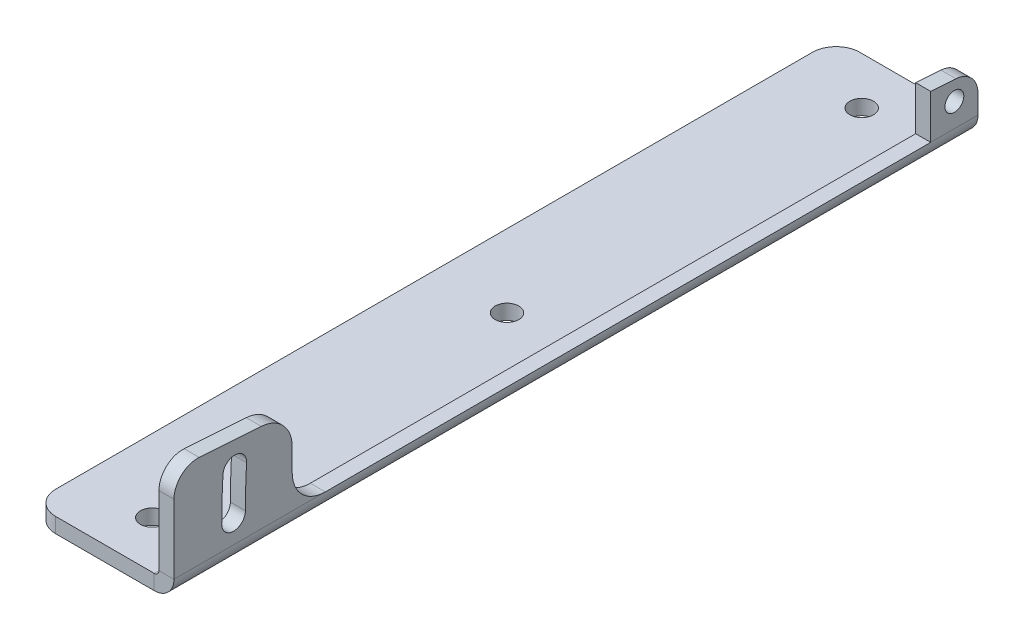
ISO-10303-21;
HEADER;
FILE_DESCRIPTION(('STEP AP214'),'2;1');
FILE_NAME('part.step','',(''),(''),'','','');
FILE_SCHEMA(('AUTOMOTIVE_DESIGN { 1 0 10303 214 1 1 1 1 }'));
ENDSEC;
DATA;
#1=APPLICATION_CONTEXT('core data for automotive mechanical design processes');
#2=APPLICATION_PROTOCOL_DEFINITION('international standard','automotive_design',2000,#1);
#3=PRODUCT_CONTEXT('',#1,'mechanical');
#4=PRODUCT('Part','Part','',(#3));
#5=PRODUCT_RELATED_PRODUCT_CATEGORY('part','',(#4));
#6=PRODUCT_DEFINITION_FORMATION('','',#4);
#7=PRODUCT_DEFINITION_CONTEXT('part definition',#1,'design');
#8=PRODUCT_DEFINITION('design','',#6,#7);
#9=PRODUCT_DEFINITION_SHAPE('','',#8);
#10=(LENGTH_UNIT() NAMED_UNIT(*) SI_UNIT(.MILLI.,.METRE.));
#11=(NAMED_UNIT(*) PLANE_ANGLE_UNIT() SI_UNIT($,.RADIAN.));
#12=(NAMED_UNIT(*) SI_UNIT($,.STERADIAN.) SOLID_ANGLE_UNIT());
#13=UNCERTAINTY_MEASURE_WITH_UNIT(LENGTH_MEASURE(1.E-05),#10,'distance_accuracy_value','');
#14=(GEOMETRIC_REPRESENTATION_CONTEXT(3) GLOBAL_UNCERTAINTY_ASSIGNED_CONTEXT((#13)) GLOBAL_UNIT_ASSIGNED_CONTEXT((#10,
#11,#12)) REPRESENTATION_CONTEXT('',''));
#15=CARTESIAN_POINT('',(0.,0.,0.));
#16=DIRECTION('',(0.,0.,1.));
#17=DIRECTION('',(1.,0.,0.));
#18=AXIS2_PLACEMENT_3D('',#15,#16,#17);
#19=CARTESIAN_POINT('',(0.,0.,170.));
#20=DIRECTION('',(1.,0.,0.));
#21=DIRECTION('',(0.,0.,-1.));
#22=AXIS2_PLACEMENT_3D('',#19,#20,#21);
#23=PLANE('',#22);
#24=CARTESIAN_POINT('',(0.,9.175,5.));
#25=DIRECTION('',(1.,0.,0.));
#26=DIRECTION('',(0.,0.,-1.));
#27=AXIS2_PLACEMENT_3D('',#24,#25,#26);
#28=CIRCLE('',#27,154.9);
#29=CARTESIAN_POINT('',(0.,9.175,159.9));
#30=VERTEX_POINT('',#29);
#31=CARTESIAN_POINT('',(0.,18.1447670603674,159.640076561294));
#32=VERTEX_POINT('',#31);
#33=EDGE_CURVE('E163',#30,#32,#28,.F.);
#34=ORIENTED_EDGE('',*,*,#33,.T.);
#35=CARTESIAN_POINT('',(0.,18.,157.144271581286));
#36=DIRECTION('',(1.,0.,0.));
#37=DIRECTION('',(0.,0.,-1.));
#38=AXIS2_PLACEMENT_3D('',#35,#36,#37);
#39=CIRCLE('',#38,2.49999999999999);
#40=CARTESIAN_POINT('',(0.,17.8552329396325,154.648466601278));
#41=VERTEX_POINT('',#40);
#42=EDGE_CURVE('E160',#32,#41,#39,.F.);
#43=ORIENTED_EDGE('',*,*,#42,.T.);
#44=CARTESIAN_POINT('',(0.,9.175,5.));
#45=DIRECTION('',(1.,0.,0.));
#46=DIRECTION('',(0.,0.,-1.));
#47=AXIS2_PLACEMENT_3D('',#44,#45,#46);
#48=CIRCLE('',#47,149.9);
#49=CARTESIAN_POINT('',(0.,9.175,154.9));
#50=VERTEX_POINT('',#49);
#51=EDGE_CURVE('E169',#50,#41,#48,.F.);
#52=ORIENTED_EDGE('',*,*,#51,.F.);
#53=CARTESIAN_POINT('',(0.,9.175,157.4));
#54=DIRECTION('',(1.,0.,0.));
#55=DIRECTION('',(0.,0.,-1.));
#56=AXIS2_PLACEMENT_3D('',#53,#54,#55);
#57=CIRCLE('',#56,2.5);
#58=EDGE_CURVE('E166',#50,#30,#57,.F.);
#59=ORIENTED_EDGE('',*,*,#58,.T.);
#60=EDGE_LOOP('',(#34,#43,#52,#59));
#61=FACE_BOUND('',#60,.T.);
#62=DIRECTION('',(0.,1.,0.));
#63=VECTOR('',#62,1.);
#64=CARTESIAN_POINT('',(0.,0.,145.));
#65=LINE('',#64,#63);
#66=CARTESIAN_POINT('',(0.,11.175,145.));
#67=VERTEX_POINT('',#66);
#68=CARTESIAN_POINT('',(0.,15.9604537596054,145.));
#69=VERTEX_POINT('',#68);
#70=EDGE_CURVE('E111',#67,#69,#65,.T.);
#71=ORIENTED_EDGE('',*,*,#70,.T.);
#72=CARTESIAN_POINT('',(0.,15.9604537596054,152.));
#73=DIRECTION('',(1.,0.,0.));
#74=DIRECTION('',(0.,0.,-1.));
#75=AXIS2_PLACEMENT_3D('',#72,#73,#74);
#76=CIRCLE('',#75,7.);
#77=CARTESIAN_POINT('',(0.,22.9449747604819,151.534740515072));
#78=VERTEX_POINT('',#77);
#79=EDGE_CURVE('E99',#69,#78,#76,.T.);
#80=ORIENTED_EDGE('',*,*,#79,.T.);
#81=DIRECTION('',(0.,0.0664656407040233,0.997788714410924));
#82=VECTOR('',#81,1.);
#83=CARTESIAN_POINT('',(0.,12.850800040137,0.));
#84=LINE('',#83,#82);
#85=CARTESIAN_POINT('',(0.,23.8197979363042,164.66767179648));
#86=VERTEX_POINT('',#85);
#87=EDGE_CURVE('E138',#78,#86,#84,.T.);
#88=ORIENTED_EDGE('',*,*,#87,.T.);
#89=CARTESIAN_POINT('',(0.,18.8308543642496,165.));
#90=DIRECTION('',(1.,0.,0.));
#91=DIRECTION('',(0.,0.,-1.));
#92=AXIS2_PLACEMENT_3D('',#89,#90,#91);
#93=CIRCLE('',#92,5.);
#94=CARTESIAN_POINT('',(0.,18.8308543642496,170.));
#95=VERTEX_POINT('',#94);
#96=EDGE_CURVE('E303',#86,#95,#93,.T.);
#97=ORIENTED_EDGE('',*,*,#96,.T.);
#98=DIRECTION('',(0.,-1.,0.));
#99=VECTOR('',#98,1.);
#100=CARTESIAN_POINT('',(0.,0.,170.));
#101=LINE('',#100,#99);
#102=CARTESIAN_POINT('',(0.,4.175,170.));
#103=VERTEX_POINT('',#102);
#104=EDGE_CURVE('E197',#95,#103,#101,.T.);
#105=ORIENTED_EDGE('',*,*,#104,.T.);
#106=DIRECTION('',(0.,0.,-1.));
#107=VECTOR('',#106,1.);
#108=CARTESIAN_POINT('',(0.,4.175,170.));
#109=LINE('',#108,#107);
#110=CARTESIAN_POINT('',(0.,4.175,138.));
#111=VERTEX_POINT('',#110);
#112=EDGE_CURVE('E74',#103,#111,#109,.T.);
#113=ORIENTED_EDGE('',*,*,#112,.T.);
#114=CARTESIAN_POINT('',(0.,11.175,138.));
#115=DIRECTION('',(1.,0.,0.));
#116=DIRECTION('',(0.,0.,-1.));
#117=AXIS2_PLACEMENT_3D('',#114,#115,#116);
#118=CIRCLE('',#117,7.);
#119=EDGE_CURVE('E44',#111,#67,#118,.F.);
#120=ORIENTED_EDGE('',*,*,#119,.T.);
#121=EDGE_LOOP('',(#71,#80,#88,#97,#105,#113,#120));
#122=FACE_BOUND('',#121,.T.);
#123=ADVANCED_FACE('F36',(#61,#122),#23,.T.);
#124=CARTESIAN_POINT('',(0.,9.175,5.));
#125=DIRECTION('',(1.,0.,0.));
#126=DIRECTION('',(0.,0.,-1.));
#127=AXIS2_PLACEMENT_3D('',#124,#125,#126);
#128=CIRCLE('',#127,2.);
#129=CARTESIAN_POINT('',(0.,9.175,3.));
#130=VERTEX_POINT('',#129);
#131=EDGE_CURVE('E159',#130,#130,#128,.F.);
#132=ORIENTED_EDGE('',*,*,#131,.T.);
#133=EDGE_LOOP('',(#132));
#134=FACE_BOUND('',#133,.T.);
#135=CARTESIAN_POINT('',(0.,13.1617273858449,4.66767179647988));
#136=VERTEX_POINT('',#135);
#137=CARTESIAN_POINT('',(0.,13.5169294495407,10.));
#138=VERTEX_POINT('',#137);
#139=EDGE_CURVE('E134',#136,#138,#84,.T.);
#140=ORIENTED_EDGE('',*,*,#139,.T.);
#141=DIRECTION('',(0.,-1.,0.));
#142=VECTOR('',#141,1.);
#143=CARTESIAN_POINT('',(0.,0.,10.));
#144=LINE('',#143,#142);
#145=CARTESIAN_POINT('',(0.,4.175,10.));
#146=VERTEX_POINT('',#145);
#147=EDGE_CURVE('E86',#138,#146,#144,.T.);
#148=ORIENTED_EDGE('',*,*,#147,.T.);
#149=CARTESIAN_POINT('',(0.,4.175,0.));
#150=VERTEX_POINT('',#149);
#151=EDGE_CURVE('E227',#146,#150,#109,.T.);
#152=ORIENTED_EDGE('',*,*,#151,.T.);
#153=DIRECTION('',(0.,-1.,0.));
#154=VECTOR('',#153,1.);
#155=CARTESIAN_POINT('',(0.,0.,0.));
#156=LINE('',#155,#154);
#157=CARTESIAN_POINT('',(0.,8.1727838137903,0.));
#158=VERTEX_POINT('',#157);
#159=EDGE_CURVE('E215',#158,#150,#156,.T.);
#160=ORIENTED_EDGE('',*,*,#159,.F.);
#161=CARTESIAN_POINT('',(0.,8.1727838137903,5.));
#162=DIRECTION('',(1.,0.,0.));
#163=DIRECTION('',(0.,0.,-1.));
#164=AXIS2_PLACEMENT_3D('',#161,#162,#163);
#165=CIRCLE('',#164,5.);
#166=EDGE_CURVE('E305',#158,#136,#165,.T.);
#167=ORIENTED_EDGE('',*,*,#166,.T.);
#168=EDGE_LOOP('',(#140,#148,#152,#160,#167));
#169=FACE_BOUND('',#168,.T.);
#170=ADVANCED_FACE('F350',(#134,#169),#23,.T.);
#171=CARTESIAN_POINT('',(-3.175,0.,170.));
#172=DIRECTION('',(1.,0.,0.));
#173=DIRECTION('',(0.,0.,-1.));
#174=AXIS2_PLACEMENT_3D('',#171,#172,#173);
#175=PLANE('',#174);
#176=CARTESIAN_POINT('',(-3.175,18.,157.144271581286));
#177=DIRECTION('',(1.,0.,0.));
#178=DIRECTION('',(0.,0.,-1.));
#179=AXIS2_PLACEMENT_3D('',#176,#177,#178);
#180=CIRCLE('',#179,2.49999999999999);
#181=CARTESIAN_POINT('',(-3.175,18.1447670603674,159.640076561294));
#182=VERTEX_POINT('',#181);
#183=CARTESIAN_POINT('',(-3.175,17.8552329396325,154.648466601278));
#184=VERTEX_POINT('',#183);
#185=EDGE_CURVE('E285',#182,#184,#180,.F.);
#186=ORIENTED_EDGE('',*,*,#185,.F.);
#187=CARTESIAN_POINT('',(-3.175,9.175,5.));
#188=DIRECTION('',(1.,0.,0.));
#189=DIRECTION('',(0.,0.,-1.));
#190=AXIS2_PLACEMENT_3D('',#187,#188,#189);
#191=CIRCLE('',#190,154.9);
#192=CARTESIAN_POINT('',(-3.175,9.175,159.9));
#193=VERTEX_POINT('',#192);
#194=EDGE_CURVE('E274',#193,#182,#191,.F.);
#195=ORIENTED_EDGE('',*,*,#194,.F.);
#196=CARTESIAN_POINT('',(-3.175,9.175,157.4));
#197=DIRECTION('',(1.,0.,0.));
#198=DIRECTION('',(0.,0.,-1.));
#199=AXIS2_PLACEMENT_3D('',#196,#197,#198);
#200=CIRCLE('',#199,2.5);
#201=CARTESIAN_POINT('',(-3.175,9.175,154.9));
#202=VERTEX_POINT('',#201);
#203=EDGE_CURVE('E279',#202,#193,#200,.F.);
#204=ORIENTED_EDGE('',*,*,#203,.F.);
#205=CARTESIAN_POINT('',(-3.175,9.175,5.));
#206=DIRECTION('',(1.,0.,0.));
#207=DIRECTION('',(0.,0.,-1.));
#208=AXIS2_PLACEMENT_3D('',#205,#206,#207);
#209=CIRCLE('',#208,149.9);
#210=EDGE_CURVE('E282',#202,#184,#209,.F.);
#211=ORIENTED_EDGE('',*,*,#210,.T.);
#212=EDGE_LOOP('',(#186,#195,#204,#211));
#213=FACE_BOUND('',#212,.T.);
#214=DIRECTION('',(0.,0.0664656407040233,0.997788714410924));
#215=VECTOR('',#214,1.);
#216=CARTESIAN_POINT('',(-3.175,12.850800040137,0.));
#217=LINE('',#216,#215);
#218=CARTESIAN_POINT('',(-3.175,22.9449747604819,151.534740515072));
#219=VERTEX_POINT('',#218);
#220=CARTESIAN_POINT('',(-3.175,23.8197979363042,164.66767179648));
#221=VERTEX_POINT('',#220);
#222=EDGE_CURVE('E132',#219,#221,#217,.T.);
#223=ORIENTED_EDGE('',*,*,#222,.F.);
#224=CARTESIAN_POINT('',(-3.175,15.9604537596054,152.));
#225=DIRECTION('',(1.,0.,0.));
#226=DIRECTION('',(0.,0.,-1.));
#227=AXIS2_PLACEMENT_3D('',#224,#225,#226);
#228=CIRCLE('',#227,7.);
#229=CARTESIAN_POINT('',(-3.175,15.9604537596054,145.));
#230=VERTEX_POINT('',#229);
#231=EDGE_CURVE('E315',#219,#230,#228,.F.);
#232=ORIENTED_EDGE('',*,*,#231,.T.);
#233=DIRECTION('',(0.,1.,0.));
#234=VECTOR('',#233,1.);
#235=CARTESIAN_POINT('',(-3.175,13.3423382382454,145.));
#236=LINE('',#235,#234);
#237=CARTESIAN_POINT('',(-3.175,11.175,145.));
#238=VERTEX_POINT('',#237);
#239=EDGE_CURVE('E114',#238,#230,#236,.T.);
#240=ORIENTED_EDGE('',*,*,#239,.F.);
#241=CARTESIAN_POINT('',(-3.175,11.175,138.));
#242=DIRECTION('',(1.,0.,0.));
#243=DIRECTION('',(0.,0.,-1.));
#244=AXIS2_PLACEMENT_3D('',#241,#242,#243);
#245=CIRCLE('',#244,7.);
#246=CARTESIAN_POINT('',(-3.175,4.175,138.));
#247=VERTEX_POINT('',#246);
#248=EDGE_CURVE('E11',#238,#247,#245,.T.);
#249=ORIENTED_EDGE('',*,*,#248,.T.);
#250=DIRECTION('',(0.,0.,-1.));
#251=VECTOR('',#250,1.);
#252=CARTESIAN_POINT('',(-3.175,4.175,170.));
#253=LINE('',#252,#251);
#254=CARTESIAN_POINT('',(-3.175,4.175,170.));
#255=VERTEX_POINT('',#254);
#256=EDGE_CURVE('E51',#255,#247,#253,.T.);
#257=ORIENTED_EDGE('',*,*,#256,.F.);
#258=DIRECTION('',(0.,1.,0.));
#259=VECTOR('',#258,1.);
#260=CARTESIAN_POINT('',(-3.175,0.,170.));
#261=LINE('',#260,#259);
#262=CARTESIAN_POINT('',(-3.175,18.8308543642496,170.));
#263=VERTEX_POINT('',#262);
#264=EDGE_CURVE('E199',#263,#255,#261,.F.);
#265=ORIENTED_EDGE('',*,*,#264,.F.);
#266=CARTESIAN_POINT('',(-3.175,18.8308543642496,165.));
#267=DIRECTION('',(1.,0.,0.));
#268=DIRECTION('',(0.,0.,-1.));
#269=AXIS2_PLACEMENT_3D('',#266,#267,#268);
#270=CIRCLE('',#269,5.);
#271=EDGE_CURVE('E294',#263,#221,#270,.F.);
#272=ORIENTED_EDGE('',*,*,#271,.T.);
#273=EDGE_LOOP('',(#223,#232,#240,#249,#257,#265,#272));
#274=FACE_BOUND('',#273,.T.);
#275=ADVANCED_FACE('F317',(#213,#274),#175,.F.);
#276=CARTESIAN_POINT('',(-3.175,9.175,5.));
#277=DIRECTION('',(1.,0.,0.));
#278=DIRECTION('',(0.,0.,-1.));
#279=AXIS2_PLACEMENT_3D('',#276,#277,#278);
#280=CIRCLE('',#279,2.);
#281=CARTESIAN_POINT('',(-3.175,9.175,3.));
#282=VERTEX_POINT('',#281);
#283=EDGE_CURVE('E176',#282,#282,#280,.F.);
#284=ORIENTED_EDGE('',*,*,#283,.F.);
#285=EDGE_LOOP('',(#284));
#286=FACE_BOUND('',#285,.T.);
#287=DIRECTION('',(0.,1.,0.));
#288=VECTOR('',#287,1.);
#289=CARTESIAN_POINT('',(-3.175,13.3423382382454,10.));
#290=LINE('',#289,#288);
#291=CARTESIAN_POINT('',(-3.175,13.5169294495407,10.));
#292=VERTEX_POINT('',#291);
#293=CARTESIAN_POINT('',(-3.175,4.175,10.));
#294=VERTEX_POINT('',#293);
#295=EDGE_CURVE('E129',#292,#294,#290,.F.);
#296=ORIENTED_EDGE('',*,*,#295,.F.);
#297=CARTESIAN_POINT('',(-3.175,13.1617273858449,4.66767179647988));
#298=VERTEX_POINT('',#297);
#299=EDGE_CURVE('E139',#298,#292,#217,.T.);
#300=ORIENTED_EDGE('',*,*,#299,.F.);
#301=CARTESIAN_POINT('',(-3.175,8.1727838137903,5.));
#302=DIRECTION('',(1.,0.,0.));
#303=DIRECTION('',(0.,0.,-1.));
#304=AXIS2_PLACEMENT_3D('',#301,#302,#303);
#305=CIRCLE('',#304,5.);
#306=CARTESIAN_POINT('',(-3.175,8.1727838137903,0.));
#307=VERTEX_POINT('',#306);
#308=EDGE_CURVE('E297',#298,#307,#305,.F.);
#309=ORIENTED_EDGE('',*,*,#308,.T.);
#310=DIRECTION('',(0.,1.,0.));
#311=VECTOR('',#310,1.);
#312=CARTESIAN_POINT('',(-3.175,0.,0.));
#313=LINE('',#312,#311);
#314=CARTESIAN_POINT('',(-3.175,4.175,0.));
#315=VERTEX_POINT('',#314);
#316=EDGE_CURVE('E218',#307,#315,#313,.F.);
#317=ORIENTED_EDGE('',*,*,#316,.T.);
#318=EDGE_CURVE('E225',#294,#315,#253,.T.);
#319=ORIENTED_EDGE('',*,*,#318,.F.);
#320=EDGE_LOOP('',(#296,#300,#309,#317,#319));
#321=FACE_BOUND('',#320,.T.);
#322=ADVANCED_FACE('F361',(#286,#321),#175,.F.);
#323=CARTESIAN_POINT('',(0.,12.850800040137,0.));
#324=DIRECTION('',(0.,-0.997788714410924,0.0664656407040234));
#325=DIRECTION('',(0.,-0.0664656407040234,-0.997788714410924));
#326=AXIS2_PLACEMENT_3D('',#323,#324,#325);
#327=PLANE('',#326);
#328=ORIENTED_EDGE('',*,*,#87,.F.);
#329=DIRECTION('',(-1.,0.,0.));
#330=VECTOR('',#329,1.);
#331=CARTESIAN_POINT('',(-3.175,22.9449747604819,151.534740515072));
#332=LINE('',#331,#330);
#333=EDGE_CURVE('E60',#78,#219,#332,.T.);
#334=ORIENTED_EDGE('',*,*,#333,.T.);
#335=ORIENTED_EDGE('',*,*,#222,.T.);
#336=DIRECTION('',(-1.,0.,0.));
#337=VECTOR('',#336,1.);
#338=CARTESIAN_POINT('',(0.,23.8197979363042,164.66767179648));
#339=LINE('',#338,#337);
#340=EDGE_CURVE('E288',#221,#86,#339,.F.);
#341=ORIENTED_EDGE('',*,*,#340,.T.);
#342=EDGE_LOOP('',(#328,#334,#335,#341));
#343=FACE_BOUND('',#342,.T.);
#344=ADVANCED_FACE('F323',(#343),#327,.F.);
#345=DIRECTION('',(-1.,0.,0.));
#346=VECTOR('',#345,1.);
#347=CARTESIAN_POINT('',(0.,13.5169294495407,10.));
#348=LINE('',#347,#346);
#349=EDGE_CURVE('E117',#292,#138,#348,.F.);
#350=ORIENTED_EDGE('',*,*,#349,.T.);
#351=ORIENTED_EDGE('',*,*,#139,.F.);
#352=DIRECTION('',(-1.,0.,0.));
#353=VECTOR('',#352,1.);
#354=CARTESIAN_POINT('',(-3.175,13.1617273858449,4.66767179647988));
#355=LINE('',#354,#353);
#356=EDGE_CURVE('E291',#136,#298,#355,.T.);
#357=ORIENTED_EDGE('',*,*,#356,.T.);
#358=ORIENTED_EDGE('',*,*,#299,.T.);
#359=EDGE_LOOP('',(#350,#351,#357,#358));
#360=FACE_BOUND('',#359,.T.);
#361=ADVANCED_FACE('F357',(#360),#327,.F.);
#362=CARTESIAN_POINT('',(-4.175,0.,170.));
#363=DIRECTION('',(0.,0.,1.));
#364=DIRECTION('',(1.,0.,0.));
#365=AXIS2_PLACEMENT_3D('',#362,#363,#364);
#366=PLANE('',#365);
#367=DIRECTION('',(0.,1.,0.));
#368=VECTOR('',#367,1.);
#369=CARTESIAN_POINT('',(-4.175,0.,170.));
#370=LINE('',#369,#368);
#371=CARTESIAN_POINT('',(-4.175,0.,170.));
#372=VERTEX_POINT('',#371);
#373=CARTESIAN_POINT('',(-4.175,3.175,170.));
#374=VERTEX_POINT('',#373);
#375=EDGE_CURVE('E247',#372,#374,#370,.T.);
#376=ORIENTED_EDGE('',*,*,#375,.F.);
#377=CARTESIAN_POINT('',(-4.175,4.175,170.));
#378=DIRECTION('',(0.,0.,-1.));
#379=DIRECTION('',(-1.,0.,0.));
#380=AXIS2_PLACEMENT_3D('',#377,#378,#379);
#381=CIRCLE('',#380,4.175);
#382=EDGE_CURVE('E194',#103,#372,#381,.T.);
#383=ORIENTED_EDGE('',*,*,#382,.F.);
#384=DIRECTION('',(1.,0.,0.));
#385=VECTOR('',#384,1.);
#386=CARTESIAN_POINT('',(-3.175,4.175,170.));
#387=LINE('',#386,#385);
#388=EDGE_CURVE('E244',#255,#103,#387,.T.);
#389=ORIENTED_EDGE('',*,*,#388,.F.);
#390=CARTESIAN_POINT('',(-4.175,4.175,170.));
#391=DIRECTION('',(0.,0.,1.));
#392=DIRECTION('',(1.,0.,0.));
#393=AXIS2_PLACEMENT_3D('',#390,#391,#392);
#394=CIRCLE('',#393,1.);
#395=EDGE_CURVE('E202',#255,#374,#394,.F.);
#396=ORIENTED_EDGE('',*,*,#395,.T.);
#397=EDGE_LOOP('',(#376,#383,#389,#396));
#398=FACE_BOUND('',#397,.T.);
#399=ADVANCED_FACE('F464',(#398),#366,.T.);
#400=CARTESIAN_POINT('',(-3.175,4.175,170.));
#401=DIRECTION('',(0.,0.,1.));
#402=DIRECTION('',(1.,0.,0.));
#403=AXIS2_PLACEMENT_3D('',#400,#401,#402);
#404=PLANE('',#403);
#405=DIRECTION('',(1.,0.,0.));
#406=VECTOR('',#405,1.);
#407=CARTESIAN_POINT('',(0.,3.175,170.));
#408=LINE('',#407,#406);
#409=CARTESIAN_POINT('',(-25.,3.175,170.));
#410=VERTEX_POINT('',#409);
#411=EDGE_CURVE('E187',#374,#410,#408,.F.);
#412=ORIENTED_EDGE('',*,*,#411,.T.);
#413=DIRECTION('',(0.,1.,0.));
#414=VECTOR('',#413,1.);
#415=CARTESIAN_POINT('',(-25.,4.175,170.));
#416=LINE('',#415,#414);
#417=CARTESIAN_POINT('',(-25.,0.,170.));
#418=VERTEX_POINT('',#417);
#419=EDGE_CURVE('E271',#410,#418,#416,.F.);
#420=ORIENTED_EDGE('',*,*,#419,.T.);
#421=DIRECTION('',(-1.,0.,0.));
#422=VECTOR('',#421,1.);
#423=CARTESIAN_POINT('',(0.,0.,170.));
#424=LINE('',#423,#422);
#425=EDGE_CURVE('E190',#372,#418,#424,.T.);
#426=ORIENTED_EDGE('',*,*,#425,.F.);
#427=ORIENTED_EDGE('',*,*,#375,.T.);
#428=EDGE_LOOP('',(#412,#420,#426,#427));
#429=FACE_BOUND('',#428,.T.);
#430=ADVANCED_FACE('F459',(#429),#404,.T.);
#431=CARTESIAN_POINT('',(0.,4.175,0.));
#432=DIRECTION('',(0.,0.,-1.));
#433=DIRECTION('',(-1.,0.,0.));
#434=AXIS2_PLACEMENT_3D('',#431,#432,#433);
#435=PLANE('',#434);
#436=DIRECTION('',(-1.,0.,0.));
#437=VECTOR('',#436,1.);
#438=CARTESIAN_POINT('',(0.,4.175,0.));
#439=LINE('',#438,#437);
#440=EDGE_CURVE('E241',#150,#315,#439,.T.);
#441=ORIENTED_EDGE('',*,*,#440,.F.);
#442=CARTESIAN_POINT('',(-4.175,4.175,0.));
#443=DIRECTION('',(0.,0.,-1.));
#444=DIRECTION('',(-1.,0.,0.));
#445=AXIS2_PLACEMENT_3D('',#442,#443,#444);
#446=CIRCLE('',#445,4.175);
#447=CARTESIAN_POINT('',(-4.175,0.,0.));
#448=VERTEX_POINT('',#447);
#449=EDGE_CURVE('E212',#150,#448,#446,.T.);
#450=ORIENTED_EDGE('',*,*,#449,.T.);
#451=DIRECTION('',(0.,-1.,0.));
#452=VECTOR('',#451,1.);
#453=CARTESIAN_POINT('',(-4.175,3.175,0.));
#454=LINE('',#453,#452);
#455=CARTESIAN_POINT('',(-4.175,3.175,0.));
#456=VERTEX_POINT('',#455);
#457=EDGE_CURVE('E238',#456,#448,#454,.T.);
#458=ORIENTED_EDGE('',*,*,#457,.F.);
#459=CARTESIAN_POINT('',(-4.175,4.175,0.));
#460=DIRECTION('',(0.,0.,1.));
#461=DIRECTION('',(1.,0.,0.));
#462=AXIS2_PLACEMENT_3D('',#459,#460,#461);
#463=CIRCLE('',#462,1.);
#464=EDGE_CURVE('E191',#315,#456,#463,.F.);
#465=ORIENTED_EDGE('',*,*,#464,.F.);
#466=EDGE_LOOP('',(#441,#450,#458,#465));
#467=FACE_BOUND('',#466,.T.);
#468=ADVANCED_FACE('F388',(#467),#435,.T.);
#469=CARTESIAN_POINT('',(-4.175,3.175,0.));
#470=DIRECTION('',(0.,0.,-1.));
#471=DIRECTION('',(-1.,0.,0.));
#472=AXIS2_PLACEMENT_3D('',#469,#470,#471);
#473=PLANE('',#472);
#474=ORIENTED_EDGE('',*,*,#316,.F.);
#475=DIRECTION('',(-1.,0.,0.));
#476=VECTOR('',#475,1.);
#477=CARTESIAN_POINT('',(0.,8.1727838137903,0.));
#478=LINE('',#477,#476);
#479=EDGE_CURVE('E300',#307,#158,#478,.F.);
#480=ORIENTED_EDGE('',*,*,#479,.T.);
#481=ORIENTED_EDGE('',*,*,#159,.T.);
#482=ORIENTED_EDGE('',*,*,#440,.T.);
#483=EDGE_LOOP('',(#474,#480,#481,#482));
#484=FACE_BOUND('',#483,.T.);
#485=ADVANCED_FACE('F343',(#484),#473,.T.);
#486=CARTESIAN_POINT('',(0.,3.175,170.));
#487=DIRECTION('',(0.,-1.,0.));
#488=DIRECTION('',(0.,0.,-1.));
#489=AXIS2_PLACEMENT_3D('',#486,#487,#488);
#490=PLANE('',#489);
#491=CARTESIAN_POINT('',(-14.5875,3.175,160.));
#492=DIRECTION('',(0.,-1.,0.));
#493=DIRECTION('',(0.,0.,-1.));
#494=AXIS2_PLACEMENT_3D('',#491,#492,#493);
#495=CIRCLE('',#494,2.5);
#496=CARTESIAN_POINT('',(-14.5875,3.175,157.5));
#497=VERTEX_POINT('',#496);
#498=EDGE_CURVE('E156',#497,#497,#495,.T.);
#499=ORIENTED_EDGE('',*,*,#498,.T.);
#500=EDGE_LOOP('',(#499));
#501=FACE_BOUND('',#500,.T.);
#502=CARTESIAN_POINT('',(-14.5875,3.175,85.));
#503=DIRECTION('',(0.,-1.,0.));
#504=DIRECTION('',(0.,0.,-1.));
#505=AXIS2_PLACEMENT_3D('',#502,#503,#504);
#506=CIRCLE('',#505,2.5);
#507=CARTESIAN_POINT('',(-14.5875,3.175,82.5));
#508=VERTEX_POINT('',#507);
#509=EDGE_CURVE('E153',#508,#508,#506,.T.);
#510=ORIENTED_EDGE('',*,*,#509,.T.);
#511=EDGE_LOOP('',(#510));
#512=FACE_BOUND('',#511,.T.);
#513=CARTESIAN_POINT('',(-14.5875,3.175,10.));
#514=DIRECTION('',(0.,-1.,0.));
#515=DIRECTION('',(0.,0.,-1.));
#516=AXIS2_PLACEMENT_3D('',#513,#514,#515);
#517=CIRCLE('',#516,2.5);
#518=CARTESIAN_POINT('',(-14.5875,3.175,7.5));
#519=VERTEX_POINT('',#518);
#520=EDGE_CURVE('E145',#519,#519,#517,.T.);
#521=ORIENTED_EDGE('',*,*,#520,.T.);
#522=EDGE_LOOP('',(#521));
#523=FACE_BOUND('',#522,.T.);
#524=DIRECTION('',(1.,0.,0.));
#525=VECTOR('',#524,1.);
#526=CARTESIAN_POINT('',(0.,3.175,0.));
#527=LINE('',#526,#525);
#528=CARTESIAN_POINT('',(-25.,3.175,0.));
#529=VERTEX_POINT('',#528);
#530=EDGE_CURVE('E206',#456,#529,#527,.F.);
#531=ORIENTED_EDGE('',*,*,#530,.T.);
#532=CARTESIAN_POINT('',(-25.,3.175,5.));
#533=DIRECTION('',(0.,-1.,0.));
#534=DIRECTION('',(0.,0.,-1.));
#535=AXIS2_PLACEMENT_3D('',#532,#533,#534);
#536=CIRCLE('',#535,5.);
#537=CARTESIAN_POINT('',(-30.,3.175,5.));
#538=VERTEX_POINT('',#537);
#539=EDGE_CURVE('E256',#529,#538,#536,.F.);
#540=ORIENTED_EDGE('',*,*,#539,.T.);
#541=DIRECTION('',(0.,0.,-1.));
#542=VECTOR('',#541,1.);
#543=CARTESIAN_POINT('',(-30.,3.175,170.));
#544=LINE('',#543,#542);
#545=CARTESIAN_POINT('',(-30.,3.175,165.));
#546=VERTEX_POINT('',#545);
#547=EDGE_CURVE('E235',#546,#538,#544,.T.);
#548=ORIENTED_EDGE('',*,*,#547,.F.);
#549=CARTESIAN_POINT('',(-25.,3.175,165.));
#550=DIRECTION('',(0.,-1.,0.));
#551=DIRECTION('',(0.,0.,-1.));
#552=AXIS2_PLACEMENT_3D('',#549,#550,#551);
#553=CIRCLE('',#552,5.);
#554=EDGE_CURVE('E253',#546,#410,#553,.F.);
#555=ORIENTED_EDGE('',*,*,#554,.T.);
#556=ORIENTED_EDGE('',*,*,#411,.F.);
#557=DIRECTION('',(0.,0.,-1.));
#558=VECTOR('',#557,1.);
#559=CARTESIAN_POINT('',(-4.175,3.175,170.));
#560=LINE('',#559,#558);
#561=EDGE_CURVE('E205',#374,#456,#560,.T.);
#562=ORIENTED_EDGE('',*,*,#561,.T.);
#563=EDGE_LOOP('',(#531,#540,#548,#555,#556,#562));
#564=FACE_BOUND('',#563,.T.);
#565=ADVANCED_FACE('F467',(#501,#512,#523,#564),#490,.F.);
#566=CARTESIAN_POINT('',(-30.,0.,170.));
#567=DIRECTION('',(-1.,0.,0.));
#568=DIRECTION('',(0.,0.,1.));
#569=AXIS2_PLACEMENT_3D('',#566,#567,#568);
#570=PLANE('',#569);
#571=ORIENTED_EDGE('',*,*,#547,.T.);
#572=DIRECTION('',(0.,1.,0.));
#573=VECTOR('',#572,1.);
#574=CARTESIAN_POINT('',(-30.,0.,5.));
#575=LINE('',#574,#573);
#576=CARTESIAN_POINT('',(-30.,0.,5.));
#577=VERTEX_POINT('',#576);
#578=EDGE_CURVE('E262',#538,#577,#575,.F.);
#579=ORIENTED_EDGE('',*,*,#578,.T.);
#580=DIRECTION('',(0.,0.,-1.));
#581=VECTOR('',#580,1.);
#582=CARTESIAN_POINT('',(-30.,0.,170.));
#583=LINE('',#582,#581);
#584=CARTESIAN_POINT('',(-30.,0.,165.));
#585=VERTEX_POINT('',#584);
#586=EDGE_CURVE('E232',#585,#577,#583,.T.);
#587=ORIENTED_EDGE('',*,*,#586,.F.);
#588=DIRECTION('',(0.,1.,0.));
#589=VECTOR('',#588,1.);
#590=CARTESIAN_POINT('',(-30.,0.,165.));
#591=LINE('',#590,#589);
#592=EDGE_CURVE('E259',#585,#546,#591,.T.);
#593=ORIENTED_EDGE('',*,*,#592,.T.);
#594=EDGE_LOOP('',(#571,#579,#587,#593));
#595=FACE_BOUND('',#594,.T.);
#596=ADVANCED_FACE('F475',(#595),#570,.T.);
#597=CARTESIAN_POINT('',(0.,0.,170.));
#598=DIRECTION('',(0.,-1.,0.));
#599=DIRECTION('',(0.,0.,-1.));
#600=AXIS2_PLACEMENT_3D('',#597,#598,#599);
#601=PLANE('',#600);
#602=CARTESIAN_POINT('',(-14.5875,0.,160.));
#603=DIRECTION('',(0.,-1.,0.));
#604=DIRECTION('',(0.,0.,-1.));
#605=AXIS2_PLACEMENT_3D('',#602,#603,#604);
#606=CIRCLE('',#605,2.5);
#607=CARTESIAN_POINT('',(-14.5875,0.,157.5));
#608=VERTEX_POINT('',#607);
#609=EDGE_CURVE('E142',#608,#608,#606,.T.);
#610=ORIENTED_EDGE('',*,*,#609,.F.);
#611=EDGE_LOOP('',(#610));
#612=FACE_BOUND('',#611,.T.);
#613=CARTESIAN_POINT('',(-14.5875,0.,85.));
#614=DIRECTION('',(0.,-1.,0.));
#615=DIRECTION('',(0.,0.,-1.));
#616=AXIS2_PLACEMENT_3D('',#613,#614,#615);
#617=CIRCLE('',#616,2.5);
#618=CARTESIAN_POINT('',(-14.5875,0.,82.5));
#619=VERTEX_POINT('',#618);
#620=EDGE_CURVE('E146',#619,#619,#617,.T.);
#621=ORIENTED_EDGE('',*,*,#620,.F.);
#622=EDGE_LOOP('',(#621));
#623=FACE_BOUND('',#622,.T.);
#624=CARTESIAN_POINT('',(-14.5875,0.,10.));
#625=DIRECTION('',(0.,-1.,0.));
#626=DIRECTION('',(0.,0.,-1.));
#627=AXIS2_PLACEMENT_3D('',#624,#625,#626);
#628=CIRCLE('',#627,2.5);
#629=CARTESIAN_POINT('',(-14.5875,0.,7.5));
#630=VERTEX_POINT('',#629);
#631=EDGE_CURVE('E137',#630,#630,#628,.T.);
#632=ORIENTED_EDGE('',*,*,#631,.F.);
#633=EDGE_LOOP('',(#632));
#634=FACE_BOUND('',#633,.T.);
#635=ORIENTED_EDGE('',*,*,#586,.T.);
#636=CARTESIAN_POINT('',(-25.,0.,5.));
#637=DIRECTION('',(0.,-1.,0.));
#638=DIRECTION('',(0.,0.,-1.));
#639=AXIS2_PLACEMENT_3D('',#636,#637,#638);
#640=CIRCLE('',#639,5.);
#641=CARTESIAN_POINT('',(-25.,0.,0.));
#642=VERTEX_POINT('',#641);
#643=EDGE_CURVE('E268',#577,#642,#640,.T.);
#644=ORIENTED_EDGE('',*,*,#643,.T.);
#645=DIRECTION('',(-1.,0.,0.));
#646=VECTOR('',#645,1.);
#647=CARTESIAN_POINT('',(0.,0.,0.));
#648=LINE('',#647,#646);
#649=EDGE_CURVE('E209',#448,#642,#648,.T.);
#650=ORIENTED_EDGE('',*,*,#649,.F.);
#651=DIRECTION('',(0.,0.,-1.));
#652=VECTOR('',#651,1.);
#653=CARTESIAN_POINT('',(-4.175,0.,170.));
#654=LINE('',#653,#652);
#655=EDGE_CURVE('E229',#372,#448,#654,.T.);
#656=ORIENTED_EDGE('',*,*,#655,.F.);
#657=ORIENTED_EDGE('',*,*,#425,.T.);
#658=CARTESIAN_POINT('',(-25.,0.,165.));
#659=DIRECTION('',(0.,-1.,0.));
#660=DIRECTION('',(0.,0.,-1.));
#661=AXIS2_PLACEMENT_3D('',#658,#659,#660);
#662=CIRCLE('',#661,5.);
#663=EDGE_CURVE('E265',#418,#585,#662,.T.);
#664=ORIENTED_EDGE('',*,*,#663,.T.);
#665=EDGE_LOOP('',(#635,#644,#650,#656,#657,#664));
#666=FACE_BOUND('',#665,.T.);
#667=ADVANCED_FACE('F479',(#612,#623,#634,#666),#601,.T.);
#668=CARTESIAN_POINT('',(-4.175,4.175,170.));
#669=DIRECTION('',(0.,0.,-1.));
#670=DIRECTION('',(-1.,0.,0.));
#671=AXIS2_PLACEMENT_3D('',#668,#669,#670);
#672=CYLINDRICAL_SURFACE('',#671,4.175);
#673=ORIENTED_EDGE('',*,*,#449,.F.);
#674=ORIENTED_EDGE('',*,*,#151,.F.);
#675=DIRECTION('',(0.,0.,1.));
#676=VECTOR('',#675,1.);
#677=CARTESIAN_POINT('',(0.,4.175,170.));
#678=LINE('',#677,#676);
#679=EDGE_CURVE('E118',#146,#111,#678,.T.);
#680=ORIENTED_EDGE('',*,*,#679,.T.);
#681=ORIENTED_EDGE('',*,*,#112,.F.);
#682=ORIENTED_EDGE('',*,*,#382,.T.);
#683=ORIENTED_EDGE('',*,*,#655,.T.);
#684=EDGE_LOOP('',(#673,#674,#680,#681,#682,#683));
#685=FACE_BOUND('',#684,.T.);
#686=ADVANCED_FACE('F378',(#685),#672,.T.);
#687=CARTESIAN_POINT('',(-4.175,4.175,170.));
#688=DIRECTION('',(0.,0.,-1.));
#689=DIRECTION('',(-1.,0.,0.));
#690=AXIS2_PLACEMENT_3D('',#687,#688,#689);
#691=CYLINDRICAL_SURFACE('',#690,1.);
#692=ORIENTED_EDGE('',*,*,#464,.T.);
#693=ORIENTED_EDGE('',*,*,#561,.F.);
#694=ORIENTED_EDGE('',*,*,#395,.F.);
#695=ORIENTED_EDGE('',*,*,#256,.T.);
#696=DIRECTION('',(0.,0.,1.));
#697=VECTOR('',#696,1.);
#698=CARTESIAN_POINT('',(-3.175,4.175,77.5));
#699=LINE('',#698,#697);
#700=EDGE_CURVE('E127',#294,#247,#699,.T.);
#701=ORIENTED_EDGE('',*,*,#700,.F.);
#702=ORIENTED_EDGE('',*,*,#318,.T.);
#703=EDGE_LOOP('',(#692,#693,#694,#695,#701,#702));
#704=FACE_BOUND('',#703,.T.);
#705=ADVANCED_FACE('F465',(#704),#691,.F.);
#706=CARTESIAN_POINT('',(-4.175,4.175,170.));
#707=DIRECTION('',(0.,0.,-1.));
#708=DIRECTION('',(-1.,0.,0.));
#709=AXIS2_PLACEMENT_3D('',#706,#707,#708);
#710=PLANE('',#709);
#711=ORIENTED_EDGE('',*,*,#104,.F.);
#712=DIRECTION('',(-1.,0.,0.));
#713=VECTOR('',#712,1.);
#714=CARTESIAN_POINT('',(-4.175,18.8308543642496,170.));
#715=LINE('',#714,#713);
#716=EDGE_CURVE('E308',#95,#263,#715,.T.);
#717=ORIENTED_EDGE('',*,*,#716,.T.);
#718=ORIENTED_EDGE('',*,*,#264,.T.);
#719=ORIENTED_EDGE('',*,*,#388,.T.);
#720=EDGE_LOOP('',(#711,#717,#718,#719));
#721=FACE_BOUND('',#720,.T.);
#722=ADVANCED_FACE('F485',(#721),#710,.F.);
#723=CARTESIAN_POINT('',(-4.175,4.175,0.));
#724=DIRECTION('',(0.,0.,-1.));
#725=DIRECTION('',(-1.,0.,0.));
#726=AXIS2_PLACEMENT_3D('',#723,#724,#725);
#727=PLANE('',#726);
#728=ORIENTED_EDGE('',*,*,#649,.T.);
#729=DIRECTION('',(0.,1.,0.));
#730=VECTOR('',#729,1.);
#731=CARTESIAN_POINT('',(-25.,4.175,0.));
#732=LINE('',#731,#730);
#733=EDGE_CURVE('E250',#642,#529,#732,.T.);
#734=ORIENTED_EDGE('',*,*,#733,.T.);
#735=ORIENTED_EDGE('',*,*,#530,.F.);
#736=ORIENTED_EDGE('',*,*,#457,.T.);
#737=EDGE_LOOP('',(#728,#734,#735,#736));
#738=FACE_BOUND('',#737,.T.);
#739=ADVANCED_FACE('F483',(#738),#727,.T.);
#740=CARTESIAN_POINT('',(-25.,4.175,5.));
#741=DIRECTION('',(0.,1.,0.));
#742=DIRECTION('',(0.,0.,1.));
#743=AXIS2_PLACEMENT_3D('',#740,#741,#742);
#744=CYLINDRICAL_SURFACE('',#743,5.);
#745=ORIENTED_EDGE('',*,*,#643,.F.);
#746=ORIENTED_EDGE('',*,*,#578,.F.);
#747=ORIENTED_EDGE('',*,*,#539,.F.);
#748=ORIENTED_EDGE('',*,*,#733,.F.);
#749=EDGE_LOOP('',(#745,#746,#747,#748));
#750=FACE_BOUND('',#749,.T.);
#751=ADVANCED_FACE('F482',(#750),#744,.T.);
#752=CARTESIAN_POINT('',(-25.,0.,165.));
#753=DIRECTION('',(0.,1.,0.));
#754=DIRECTION('',(0.,0.,1.));
#755=AXIS2_PLACEMENT_3D('',#752,#753,#754);
#756=CYLINDRICAL_SURFACE('',#755,5.);
#757=ORIENTED_EDGE('',*,*,#663,.F.);
#758=ORIENTED_EDGE('',*,*,#419,.F.);
#759=ORIENTED_EDGE('',*,*,#554,.F.);
#760=ORIENTED_EDGE('',*,*,#592,.F.);
#761=EDGE_LOOP('',(#757,#758,#759,#760));
#762=FACE_BOUND('',#761,.T.);
#763=ADVANCED_FACE('F472',(#762),#756,.T.);
#764=CARTESIAN_POINT('',(-30.,9.175,5.));
#765=DIRECTION('',(1.,0.,0.));
#766=DIRECTION('',(0.,0.,-1.));
#767=AXIS2_PLACEMENT_3D('',#764,#765,#766);
#768=CYLINDRICAL_SURFACE('',#767,2.);
#769=ORIENTED_EDGE('',*,*,#131,.F.);
#770=EDGE_LOOP('',(#769));
#771=FACE_BOUND('',#770,.T.);
#772=ORIENTED_EDGE('',*,*,#283,.T.);
#773=EDGE_LOOP('',(#772));
#774=FACE_BOUND('',#773,.T.);
#775=ADVANCED_FACE('F524',(#771,#774),#768,.F.);
#776=CARTESIAN_POINT('',(-30.,18.,157.144271581286));
#777=DIRECTION('',(1.,0.,0.));
#778=DIRECTION('',(0.,0.,-1.));
#779=AXIS2_PLACEMENT_3D('',#776,#777,#778);
#780=CYLINDRICAL_SURFACE('',#779,2.49999999999999);
#781=ORIENTED_EDGE('',*,*,#185,.T.);
#782=DIRECTION('',(1.,0.,0.));
#783=VECTOR('',#782,1.);
#784=CARTESIAN_POINT('',(-30.,17.8552329396325,154.648466601278));
#785=LINE('',#784,#783);
#786=EDGE_CURVE('E173',#184,#41,#785,.T.);
#787=ORIENTED_EDGE('',*,*,#786,.T.);
#788=ORIENTED_EDGE('',*,*,#42,.F.);
#789=DIRECTION('',(1.,0.,0.));
#790=VECTOR('',#789,1.);
#791=CARTESIAN_POINT('',(-30.,18.1447670603674,159.640076561294));
#792=LINE('',#791,#790);
#793=EDGE_CURVE('E172',#182,#32,#792,.T.);
#794=ORIENTED_EDGE('',*,*,#793,.F.);
#795=EDGE_LOOP('',(#781,#787,#788,#794));
#796=FACE_BOUND('',#795,.T.);
#797=ADVANCED_FACE('F427',(#796),#780,.F.);
#798=CARTESIAN_POINT('',(-30.,9.175,5.));
#799=DIRECTION('',(1.,0.,0.));
#800=DIRECTION('',(0.,0.,-1.));
#801=AXIS2_PLACEMENT_3D('',#798,#799,#800);
#802=CYLINDRICAL_SURFACE('',#801,149.9);
#803=DIRECTION('',(1.,0.,0.));
#804=VECTOR('',#803,1.);
#805=CARTESIAN_POINT('',(-30.,9.175,154.9));
#806=LINE('',#805,#804);
#807=EDGE_CURVE('E177',#202,#50,#806,.T.);
#808=ORIENTED_EDGE('',*,*,#807,.T.);
#809=ORIENTED_EDGE('',*,*,#51,.T.);
#810=ORIENTED_EDGE('',*,*,#786,.F.);
#811=ORIENTED_EDGE('',*,*,#210,.F.);
#812=EDGE_LOOP('',(#808,#809,#810,#811));
#813=FACE_BOUND('',#812,.T.);
#814=ADVANCED_FACE('F557',(#813),#802,.T.);
#815=CARTESIAN_POINT('',(-30.,9.175,157.4));
#816=DIRECTION('',(1.,0.,0.));
#817=DIRECTION('',(0.,0.,-1.));
#818=AXIS2_PLACEMENT_3D('',#815,#816,#817);
#819=CYLINDRICAL_SURFACE('',#818,2.5);
#820=ORIENTED_EDGE('',*,*,#203,.T.);
#821=DIRECTION('',(1.,0.,0.));
#822=VECTOR('',#821,1.);
#823=CARTESIAN_POINT('',(-30.,9.175,159.9));
#824=LINE('',#823,#822);
#825=EDGE_CURVE('E180',#193,#30,#824,.T.);
#826=ORIENTED_EDGE('',*,*,#825,.T.);
#827=ORIENTED_EDGE('',*,*,#58,.F.);
#828=ORIENTED_EDGE('',*,*,#807,.F.);
#829=EDGE_LOOP('',(#820,#826,#827,#828));
#830=FACE_BOUND('',#829,.T.);
#831=ADVANCED_FACE('F443',(#830),#819,.F.);
#832=CARTESIAN_POINT('',(-30.,9.175,5.));
#833=DIRECTION('',(1.,0.,0.));
#834=DIRECTION('',(0.,0.,-1.));
#835=AXIS2_PLACEMENT_3D('',#832,#833,#834);
#836=CYLINDRICAL_SURFACE('',#835,154.9);
#837=ORIENTED_EDGE('',*,*,#194,.T.);
#838=ORIENTED_EDGE('',*,*,#793,.T.);
#839=ORIENTED_EDGE('',*,*,#33,.F.);
#840=ORIENTED_EDGE('',*,*,#825,.F.);
#841=EDGE_LOOP('',(#837,#838,#839,#840));
#842=FACE_BOUND('',#841,.T.);
#843=ADVANCED_FACE('F436',(#842),#836,.F.);
#844=CARTESIAN_POINT('',(-14.5875,40.,10.));
#845=DIRECTION('',(0.,-1.,0.));
#846=DIRECTION('',(0.,0.,-1.));
#847=AXIS2_PLACEMENT_3D('',#844,#845,#846);
#848=CYLINDRICAL_SURFACE('',#847,2.5);
#849=ORIENTED_EDGE('',*,*,#631,.T.);
#850=EDGE_LOOP('',(#849));
#851=FACE_BOUND('',#850,.T.);
#852=ORIENTED_EDGE('',*,*,#520,.F.);
#853=EDGE_LOOP('',(#852));
#854=FACE_BOUND('',#853,.T.);
#855=ADVANCED_FACE('F552',(#851,#854),#848,.F.);
#856=CARTESIAN_POINT('',(-14.5875,40.,85.));
#857=DIRECTION('',(0.,-1.,0.));
#858=DIRECTION('',(0.,0.,-1.));
#859=AXIS2_PLACEMENT_3D('',#856,#857,#858);
#860=CYLINDRICAL_SURFACE('',#859,2.5);
#861=ORIENTED_EDGE('',*,*,#620,.T.);
#862=EDGE_LOOP('',(#861));
#863=FACE_BOUND('',#862,.T.);
#864=ORIENTED_EDGE('',*,*,#509,.F.);
#865=EDGE_LOOP('',(#864));
#866=FACE_BOUND('',#865,.T.);
#867=ADVANCED_FACE('F548',(#863,#866),#860,.F.);
#868=CARTESIAN_POINT('',(-14.5875,40.,160.));
#869=DIRECTION('',(0.,-1.,0.));
#870=DIRECTION('',(0.,0.,-1.));
#871=AXIS2_PLACEMENT_3D('',#868,#869,#870);
#872=CYLINDRICAL_SURFACE('',#871,2.5);
#873=ORIENTED_EDGE('',*,*,#609,.T.);
#874=EDGE_LOOP('',(#873));
#875=FACE_BOUND('',#874,.T.);
#876=ORIENTED_EDGE('',*,*,#498,.F.);
#877=EDGE_LOOP('',(#876));
#878=FACE_BOUND('',#877,.T.);
#879=ADVANCED_FACE('F528',(#875,#878),#872,.F.);
#880=CARTESIAN_POINT('',(0.,8.1727838137903,5.));
#881=DIRECTION('',(1.,0.,0.));
#882=DIRECTION('',(0.,0.,-1.));
#883=AXIS2_PLACEMENT_3D('',#880,#881,#882);
#884=CYLINDRICAL_SURFACE('',#883,5.);
#885=ORIENTED_EDGE('',*,*,#166,.F.);
#886=ORIENTED_EDGE('',*,*,#479,.F.);
#887=ORIENTED_EDGE('',*,*,#308,.F.);
#888=ORIENTED_EDGE('',*,*,#356,.F.);
#889=EDGE_LOOP('',(#885,#886,#887,#888));
#890=FACE_BOUND('',#889,.T.);
#891=ADVANCED_FACE('F354',(#890),#884,.T.);
#892=CARTESIAN_POINT('',(-4.175,18.8308543642496,165.));
#893=DIRECTION('',(-1.,0.,0.));
#894=DIRECTION('',(0.,0.,1.));
#895=AXIS2_PLACEMENT_3D('',#892,#893,#894);
#896=CYLINDRICAL_SURFACE('',#895,5.);
#897=ORIENTED_EDGE('',*,*,#96,.F.);
#898=ORIENTED_EDGE('',*,*,#340,.F.);
#899=ORIENTED_EDGE('',*,*,#271,.F.);
#900=ORIENTED_EDGE('',*,*,#716,.F.);
#901=EDGE_LOOP('',(#897,#898,#899,#900));
#902=FACE_BOUND('',#901,.T.);
#903=ADVANCED_FACE('F527',(#902),#896,.T.);
#904=CARTESIAN_POINT('',(0.,4.175,170.));
#905=DIRECTION('',(0.,-1.,0.));
#906=DIRECTION('',(0.,0.,1.));
#907=AXIS2_PLACEMENT_3D('',#904,#905,#906);
#908=PLANE('',#907);
#909=ORIENTED_EDGE('',*,*,#700,.T.);
#910=DIRECTION('',(-1.,0.,0.));
#911=VECTOR('',#910,1.);
#912=CARTESIAN_POINT('',(0.,4.175,138.));
#913=LINE('',#912,#911);
#914=EDGE_CURVE('E115',#247,#111,#913,.F.);
#915=ORIENTED_EDGE('',*,*,#914,.T.);
#916=ORIENTED_EDGE('',*,*,#679,.F.);
#917=DIRECTION('',(-1.,0.,0.));
#918=VECTOR('',#917,1.);
#919=CARTESIAN_POINT('',(0.,4.175,10.));
#920=LINE('',#919,#918);
#921=EDGE_CURVE('E120',#294,#146,#920,.F.);
#922=ORIENTED_EDGE('',*,*,#921,.F.);
#923=EDGE_LOOP('',(#909,#915,#916,#922));
#924=FACE_BOUND('',#923,.T.);
#925=ADVANCED_FACE('F372',(#924),#908,.F.);
#926=CARTESIAN_POINT('',(0.,0.,145.));
#927=DIRECTION('',(0.,0.,1.));
#928=DIRECTION('',(0.,1.,0.));
#929=AXIS2_PLACEMENT_3D('',#926,#927,#928);
#930=PLANE('',#929);
#931=ORIENTED_EDGE('',*,*,#70,.F.);
#932=DIRECTION('',(-1.,0.,0.));
#933=VECTOR('',#932,1.);
#934=CARTESIAN_POINT('',(-3.175,11.175,145.));
#935=LINE('',#934,#933);
#936=EDGE_CURVE('E105',#67,#238,#935,.T.);
#937=ORIENTED_EDGE('',*,*,#936,.T.);
#938=ORIENTED_EDGE('',*,*,#239,.T.);
#939=DIRECTION('',(1.,0.,0.));
#940=VECTOR('',#939,1.);
#941=CARTESIAN_POINT('',(0.,15.9604537596054,145.));
#942=LINE('',#941,#940);
#943=EDGE_CURVE('E102',#230,#69,#942,.T.);
#944=ORIENTED_EDGE('',*,*,#943,.T.);
#945=EDGE_LOOP('',(#931,#937,#938,#944));
#946=FACE_BOUND('',#945,.T.);
#947=ADVANCED_FACE('F110',(#946),#930,.F.);
#948=CARTESIAN_POINT('',(0.,0.,10.));
#949=DIRECTION('',(0.,0.,-1.));
#950=DIRECTION('',(0.,-1.,0.));
#951=AXIS2_PLACEMENT_3D('',#948,#949,#950);
#952=PLANE('',#951);
#953=ORIENTED_EDGE('',*,*,#295,.T.);
#954=ORIENTED_EDGE('',*,*,#921,.T.);
#955=ORIENTED_EDGE('',*,*,#147,.F.);
#956=ORIENTED_EDGE('',*,*,#349,.F.);
#957=EDGE_LOOP('',(#953,#954,#955,#956));
#958=FACE_BOUND('',#957,.T.);
#959=ADVANCED_FACE('F367',(#958),#952,.F.);
#960=CARTESIAN_POINT('',(0.,11.175,138.));
#961=DIRECTION('',(-1.,0.,0.));
#962=DIRECTION('',(0.,0.,1.));
#963=AXIS2_PLACEMENT_3D('',#960,#961,#962);
#964=CYLINDRICAL_SURFACE('',#963,7.);
#965=ORIENTED_EDGE('',*,*,#248,.F.);
#966=ORIENTED_EDGE('',*,*,#936,.F.);
#967=ORIENTED_EDGE('',*,*,#119,.F.);
#968=ORIENTED_EDGE('',*,*,#914,.F.);
#969=EDGE_LOOP('',(#965,#966,#967,#968));
#970=FACE_BOUND('',#969,.T.);
#971=ADVANCED_FACE('F531',(#970),#964,.F.);
#972=CARTESIAN_POINT('',(0.,15.9604537596054,152.));
#973=DIRECTION('',(1.,0.,0.));
#974=DIRECTION('',(0.,0.,-1.));
#975=AXIS2_PLACEMENT_3D('',#972,#973,#974);
#976=CYLINDRICAL_SURFACE('',#975,7.);
#977=ORIENTED_EDGE('',*,*,#231,.F.);
#978=ORIENTED_EDGE('',*,*,#333,.F.);
#979=ORIENTED_EDGE('',*,*,#79,.F.);
#980=ORIENTED_EDGE('',*,*,#943,.F.);
#981=EDGE_LOOP('',(#977,#978,#979,#980));
#982=FACE_BOUND('',#981,.T.);
#983=ADVANCED_FACE('F38',(#982),#976,.T.);
#984=CLOSED_SHELL('',(#123,#170,#275,#322,#344,#361,#399,#430,#468,#485,#565,#596,#667,#686,
#705,#722,#739,#751,#763,#775,#797,#814,#831,#843,#855,#867,#879,#891,#903,#925,#947,#959,#971,#983));
#985=MANIFOLD_SOLID_BREP('B2',#984);
#986=ADVANCED_BREP_SHAPE_REPRESENTATION('',(#18,#985),#14);
#987=SHAPE_DEFINITION_REPRESENTATION(#9,#986);
ENDSEC;
END-ISO-10303-21;
